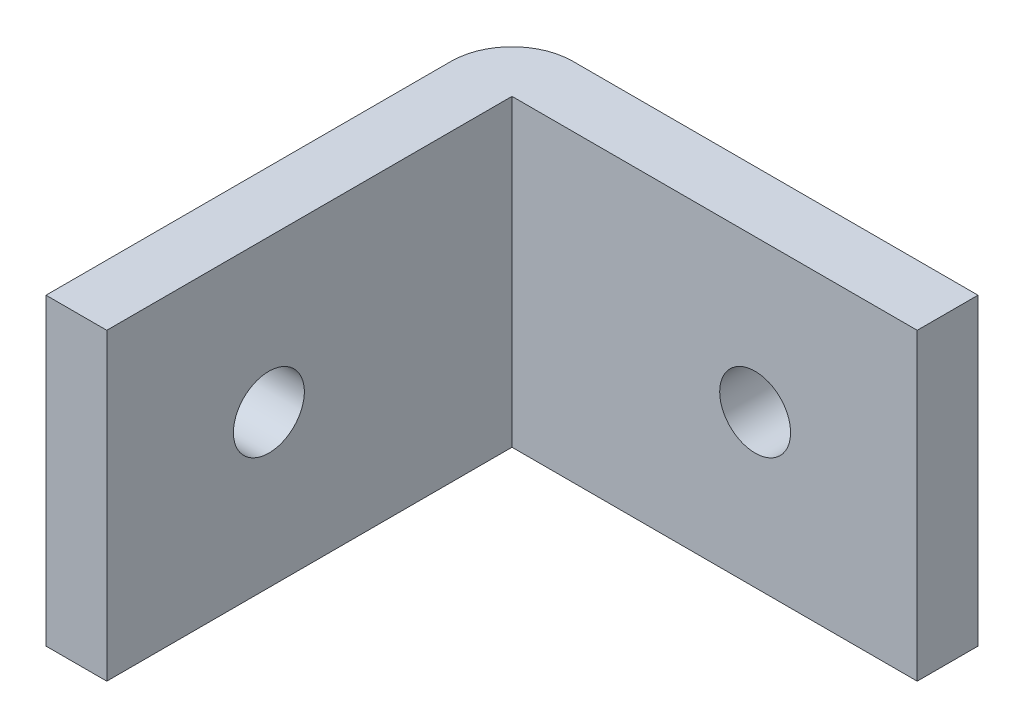
ISO-10303-21;
HEADER;
FILE_DESCRIPTION(('STEP AP214'),'2;1');
FILE_NAME('part.step','',(''),(''),'','','');
FILE_SCHEMA(('AUTOMOTIVE_DESIGN { 1 0 10303 214 1 1 1 1 }'));
ENDSEC;
DATA;
#1=APPLICATION_CONTEXT('core data for automotive mechanical design processes');
#2=APPLICATION_PROTOCOL_DEFINITION('international standard','automotive_design',2000,#1);
#3=PRODUCT_CONTEXT('',#1,'mechanical');
#4=PRODUCT('Part','Part','',(#3));
#5=PRODUCT_RELATED_PRODUCT_CATEGORY('part','',(#4));
#6=PRODUCT_DEFINITION_FORMATION('','',#4);
#7=PRODUCT_DEFINITION_CONTEXT('part definition',#1,'design');
#8=PRODUCT_DEFINITION('design','',#6,#7);
#9=PRODUCT_DEFINITION_SHAPE('','',#8);
#10=(LENGTH_UNIT() NAMED_UNIT(*) SI_UNIT(.MILLI.,.METRE.));
#11=(NAMED_UNIT(*) PLANE_ANGLE_UNIT() SI_UNIT($,.RADIAN.));
#12=(NAMED_UNIT(*) SI_UNIT($,.STERADIAN.) SOLID_ANGLE_UNIT());
#13=UNCERTAINTY_MEASURE_WITH_UNIT(LENGTH_MEASURE(1.E-05),#10,'distance_accuracy_value','');
#14=(GEOMETRIC_REPRESENTATION_CONTEXT(3) GLOBAL_UNCERTAINTY_ASSIGNED_CONTEXT((#13)) GLOBAL_UNIT_ASSIGNED_CONTEXT((#10,
#11,#12)) REPRESENTATION_CONTEXT('',''));
#15=CARTESIAN_POINT('',(0.,0.,0.));
#16=DIRECTION('',(0.,0.,1.));
#17=DIRECTION('',(1.,0.,0.));
#18=AXIS2_PLACEMENT_3D('',#15,#16,#17);
#19=CARTESIAN_POINT('',(0.,0.,3.));
#20=DIRECTION('',(0.,0.,-1.));
#21=DIRECTION('',(-1.,0.,0.));
#22=AXIS2_PLACEMENT_3D('',#19,#20,#21);
#23=PLANE('',#22);
#24=CARTESIAN_POINT('',(3.5,0.,3.));
#25=DIRECTION('',(0.,0.,-1.));
#26=DIRECTION('',(-1.,0.,0.));
#27=AXIS2_PLACEMENT_3D('',#24,#25,#26);
#28=CIRCLE('',#27,1.75);
#29=CARTESIAN_POINT('',(1.75,0.,3.));
#30=VERTEX_POINT('',#29);
#31=EDGE_CURVE('E120',#30,#30,#28,.T.);
#32=ORIENTED_EDGE('',*,*,#31,.T.);
#33=EDGE_LOOP('',(#32));
#34=FACE_BOUND('',#33,.T.);
#35=DIRECTION('',(0.,1.,0.));
#36=VECTOR('',#35,1.);
#37=CARTESIAN_POINT('',(-8.5,7.5,3.));
#38=LINE('',#37,#36);
#39=CARTESIAN_POINT('',(-8.5,-7.5,3.));
#40=VERTEX_POINT('',#39);
#41=CARTESIAN_POINT('',(-8.5,7.5,3.));
#42=VERTEX_POINT('',#41);
#43=EDGE_CURVE('E117',#40,#42,#38,.T.);
#44=ORIENTED_EDGE('',*,*,#43,.F.);
#45=DIRECTION('',(1.,0.,0.));
#46=VECTOR('',#45,1.);
#47=CARTESIAN_POINT('',(-11.5,-7.5,3.));
#48=LINE('',#47,#46);
#49=CARTESIAN_POINT('',(11.5,-7.5,3.));
#50=VERTEX_POINT('',#49);
#51=EDGE_CURVE('E138',#40,#50,#48,.T.);
#52=ORIENTED_EDGE('',*,*,#51,.T.);
#53=DIRECTION('',(0.,1.,0.));
#54=VECTOR('',#53,1.);
#55=CARTESIAN_POINT('',(11.5,-7.5,3.));
#56=LINE('',#55,#54);
#57=CARTESIAN_POINT('',(11.5,7.5,3.));
#58=VERTEX_POINT('',#57);
#59=EDGE_CURVE('E132',#50,#58,#56,.T.);
#60=ORIENTED_EDGE('',*,*,#59,.T.);
#61=DIRECTION('',(-1.,0.,0.));
#62=VECTOR('',#61,1.);
#63=CARTESIAN_POINT('',(-11.5,7.5,3.));
#64=LINE('',#63,#62);
#65=EDGE_CURVE('E135',#58,#42,#64,.T.);
#66=ORIENTED_EDGE('',*,*,#65,.T.);
#67=EDGE_LOOP('',(#44,#52,#60,#66));
#68=FACE_BOUND('',#67,.T.);
#69=ADVANCED_FACE('F35',(#34,#68),#23,.F.);
#70=CARTESIAN_POINT('',(11.5,-7.5,3.));
#71=DIRECTION('',(-1.,0.,0.));
#72=DIRECTION('',(0.,0.,1.));
#73=AXIS2_PLACEMENT_3D('',#70,#71,#72);
#74=PLANE('',#73);
#75=DIRECTION('',(0.,1.,0.));
#76=VECTOR('',#75,1.);
#77=CARTESIAN_POINT('',(11.5,-7.5,0.));
#78=LINE('',#77,#76);
#79=CARTESIAN_POINT('',(11.5,-7.5,0.));
#80=VERTEX_POINT('',#79);
#81=CARTESIAN_POINT('',(11.5,7.5,0.));
#82=VERTEX_POINT('',#81);
#83=EDGE_CURVE('E131',#80,#82,#78,.T.);
#84=ORIENTED_EDGE('',*,*,#83,.T.);
#85=DIRECTION('',(0.,0.,-1.));
#86=VECTOR('',#85,1.);
#87=CARTESIAN_POINT('',(11.5,7.5,3.));
#88=LINE('',#87,#86);
#89=EDGE_CURVE('E148',#58,#82,#88,.T.);
#90=ORIENTED_EDGE('',*,*,#89,.F.);
#91=ORIENTED_EDGE('',*,*,#59,.F.);
#92=DIRECTION('',(0.,0.,-1.));
#93=VECTOR('',#92,1.);
#94=CARTESIAN_POINT('',(11.5,-7.5,3.));
#95=LINE('',#94,#93);
#96=EDGE_CURVE('E101',#50,#80,#95,.T.);
#97=ORIENTED_EDGE('',*,*,#96,.T.);
#98=EDGE_LOOP('',(#84,#90,#91,#97));
#99=FACE_BOUND('',#98,.T.);
#100=ADVANCED_FACE('F176',(#99),#74,.F.);
#101=CARTESIAN_POINT('',(-11.5,7.5,3.));
#102=DIRECTION('',(0.,-1.,0.));
#103=DIRECTION('',(0.,0.,-1.));
#104=AXIS2_PLACEMENT_3D('',#101,#102,#103);
#105=PLANE('',#104);
#106=DIRECTION('',(-1.,0.,0.));
#107=VECTOR('',#106,1.);
#108=CARTESIAN_POINT('',(-11.5,7.5,0.));
#109=LINE('',#108,#107);
#110=CARTESIAN_POINT('',(-8.5,7.5,0.));
#111=VERTEX_POINT('',#110);
#112=EDGE_CURVE('E142',#82,#111,#109,.T.);
#113=ORIENTED_EDGE('',*,*,#112,.T.);
#114=CARTESIAN_POINT('',(-8.5,7.5,3.));
#115=DIRECTION('',(0.,-1.,0.));
#116=DIRECTION('',(0.,0.,-1.));
#117=AXIS2_PLACEMENT_3D('',#114,#115,#116);
#118=CIRCLE('',#117,3.);
#119=CARTESIAN_POINT('',(-11.5,7.5,3.));
#120=VERTEX_POINT('',#119);
#121=EDGE_CURVE('E11',#111,#120,#118,.F.);
#122=ORIENTED_EDGE('',*,*,#121,.T.);
#123=DIRECTION('',(0.,0.,-1.));
#124=VECTOR('',#123,1.);
#125=CARTESIAN_POINT('',(-11.5,7.5,3.));
#126=LINE('',#125,#124);
#127=CARTESIAN_POINT('',(-11.5,7.5,23.));
#128=VERTEX_POINT('',#127);
#129=EDGE_CURVE('E100',#128,#120,#126,.T.);
#130=ORIENTED_EDGE('',*,*,#129,.F.);
#131=DIRECTION('',(-1.,0.,0.));
#132=VECTOR('',#131,1.);
#133=CARTESIAN_POINT('',(-11.5,7.5,23.));
#134=LINE('',#133,#132);
#135=CARTESIAN_POINT('',(-8.5,7.5,23.));
#136=VERTEX_POINT('',#135);
#137=EDGE_CURVE('E116',#136,#128,#134,.T.);
#138=ORIENTED_EDGE('',*,*,#137,.F.);
#139=DIRECTION('',(0.,0.,-1.));
#140=VECTOR('',#139,1.);
#141=CARTESIAN_POINT('',(-8.5,7.5,23.));
#142=LINE('',#141,#140);
#143=EDGE_CURVE('E126',#136,#42,#142,.T.);
#144=ORIENTED_EDGE('',*,*,#143,.T.);
#145=ORIENTED_EDGE('',*,*,#65,.F.);
#146=ORIENTED_EDGE('',*,*,#89,.T.);
#147=EDGE_LOOP('',(#113,#122,#130,#138,#144,#145,#146));
#148=FACE_BOUND('',#147,.T.);
#149=ADVANCED_FACE('F168',(#148),#105,.F.);
#150=CARTESIAN_POINT('',(-11.5,-7.5,3.));
#151=DIRECTION('',(1.,0.,0.));
#152=DIRECTION('',(0.,0.,-1.));
#153=AXIS2_PLACEMENT_3D('',#150,#151,#152);
#154=PLANE('',#153);
#155=CARTESIAN_POINT('',(-11.5,0.,15.));
#156=DIRECTION('',(-1.,0.,0.));
#157=DIRECTION('',(0.,0.,1.));
#158=AXIS2_PLACEMENT_3D('',#155,#156,#157);
#159=CIRCLE('',#158,1.75);
#160=CARTESIAN_POINT('',(-11.5,0.,16.75));
#161=VERTEX_POINT('',#160);
#162=EDGE_CURVE('E155',#161,#161,#159,.T.);
#163=ORIENTED_EDGE('',*,*,#162,.F.);
#164=EDGE_LOOP('',(#163));
#165=FACE_BOUND('',#164,.T.);
#166=ORIENTED_EDGE('',*,*,#129,.T.);
#167=DIRECTION('',(0.,-1.,0.));
#168=VECTOR('',#167,1.);
#169=CARTESIAN_POINT('',(-11.5,-7.5,3.));
#170=LINE('',#169,#168);
#171=CARTESIAN_POINT('',(-11.5,-7.5,3.));
#172=VERTEX_POINT('',#171);
#173=EDGE_CURVE('E99',#120,#172,#170,.T.);
#174=ORIENTED_EDGE('',*,*,#173,.T.);
#175=DIRECTION('',(0.,0.,-1.));
#176=VECTOR('',#175,1.);
#177=CARTESIAN_POINT('',(-11.5,-7.5,3.));
#178=LINE('',#177,#176);
#179=CARTESIAN_POINT('',(-11.5,-7.5,23.));
#180=VERTEX_POINT('',#179);
#181=EDGE_CURVE('E92',#180,#172,#178,.T.);
#182=ORIENTED_EDGE('',*,*,#181,.F.);
#183=DIRECTION('',(0.,-1.,0.));
#184=VECTOR('',#183,1.);
#185=CARTESIAN_POINT('',(-11.5,7.5,23.));
#186=LINE('',#185,#184);
#187=EDGE_CURVE('E97',#128,#180,#186,.T.);
#188=ORIENTED_EDGE('',*,*,#187,.F.);
#189=EDGE_LOOP('',(#166,#174,#182,#188));
#190=FACE_BOUND('',#189,.T.);
#191=ADVANCED_FACE('F95',(#165,#190),#154,.F.);
#192=CARTESIAN_POINT('',(-11.5,-7.5,3.));
#193=DIRECTION('',(0.,1.,0.));
#194=DIRECTION('',(0.,0.,1.));
#195=AXIS2_PLACEMENT_3D('',#192,#193,#194);
#196=PLANE('',#195);
#197=ORIENTED_EDGE('',*,*,#181,.T.);
#198=CARTESIAN_POINT('',(-8.5,-7.5,3.));
#199=DIRECTION('',(0.,1.,0.));
#200=DIRECTION('',(0.,0.,1.));
#201=AXIS2_PLACEMENT_3D('',#198,#199,#200);
#202=CIRCLE('',#201,3.);
#203=CARTESIAN_POINT('',(-8.5,-7.5,0.));
#204=VERTEX_POINT('',#203);
#205=EDGE_CURVE('E57',#172,#204,#202,.F.);
#206=ORIENTED_EDGE('',*,*,#205,.T.);
#207=DIRECTION('',(1.,0.,0.));
#208=VECTOR('',#207,1.);
#209=CARTESIAN_POINT('',(-11.5,-7.5,0.));
#210=LINE('',#209,#208);
#211=EDGE_CURVE('E136',#204,#80,#210,.T.);
#212=ORIENTED_EDGE('',*,*,#211,.T.);
#213=ORIENTED_EDGE('',*,*,#96,.F.);
#214=ORIENTED_EDGE('',*,*,#51,.F.);
#215=DIRECTION('',(0.,0.,-1.));
#216=VECTOR('',#215,1.);
#217=CARTESIAN_POINT('',(-8.5,-7.5,23.));
#218=LINE('',#217,#216);
#219=CARTESIAN_POINT('',(-8.5,-7.5,23.));
#220=VERTEX_POINT('',#219);
#221=EDGE_CURVE('E108',#220,#40,#218,.T.);
#222=ORIENTED_EDGE('',*,*,#221,.F.);
#223=DIRECTION('',(1.,0.,0.));
#224=VECTOR('',#223,1.);
#225=CARTESIAN_POINT('',(-11.5,-7.5,23.));
#226=LINE('',#225,#224);
#227=EDGE_CURVE('E104',#180,#220,#226,.T.);
#228=ORIENTED_EDGE('',*,*,#227,.F.);
#229=EDGE_LOOP('',(#197,#206,#212,#213,#214,#222,#228));
#230=FACE_BOUND('',#229,.T.);
#231=ADVANCED_FACE('F105',(#230),#196,.F.);
#232=CARTESIAN_POINT('',(0.,0.,0.));
#233=DIRECTION('',(0.,0.,-1.));
#234=DIRECTION('',(-1.,0.,0.));
#235=AXIS2_PLACEMENT_3D('',#232,#233,#234);
#236=PLANE('',#235);
#237=CARTESIAN_POINT('',(3.5,0.,0.));
#238=DIRECTION('',(0.,0.,-1.));
#239=DIRECTION('',(-1.,0.,0.));
#240=AXIS2_PLACEMENT_3D('',#237,#238,#239);
#241=CIRCLE('',#240,1.75);
#242=CARTESIAN_POINT('',(1.75,0.,0.));
#243=VERTEX_POINT('',#242);
#244=EDGE_CURVE('E154',#243,#243,#241,.T.);
#245=ORIENTED_EDGE('',*,*,#244,.F.);
#246=EDGE_LOOP('',(#245));
#247=FACE_BOUND('',#246,.T.);
#248=ORIENTED_EDGE('',*,*,#211,.F.);
#249=DIRECTION('',(0.,-1.,0.));
#250=VECTOR('',#249,1.);
#251=CARTESIAN_POINT('',(-8.5,7.5,0.));
#252=LINE('',#251,#250);
#253=EDGE_CURVE('E43',#204,#111,#252,.F.);
#254=ORIENTED_EDGE('',*,*,#253,.T.);
#255=ORIENTED_EDGE('',*,*,#112,.F.);
#256=ORIENTED_EDGE('',*,*,#83,.F.);
#257=EDGE_LOOP('',(#248,#254,#255,#256));
#258=FACE_BOUND('',#257,.T.);
#259=ADVANCED_FACE('F174',(#247,#258),#236,.T.);
#260=CARTESIAN_POINT('',(-8.5,7.5,23.));
#261=DIRECTION('',(-1.,0.,0.));
#262=DIRECTION('',(0.,0.,1.));
#263=AXIS2_PLACEMENT_3D('',#260,#261,#262);
#264=PLANE('',#263);
#265=CARTESIAN_POINT('',(-8.5,0.,15.));
#266=DIRECTION('',(-1.,0.,0.));
#267=DIRECTION('',(0.,0.,1.));
#268=AXIS2_PLACEMENT_3D('',#265,#266,#267);
#269=CIRCLE('',#268,1.75);
#270=CARTESIAN_POINT('',(-8.5,0.,16.75));
#271=VERTEX_POINT('',#270);
#272=EDGE_CURVE('E151',#271,#271,#269,.T.);
#273=ORIENTED_EDGE('',*,*,#272,.T.);
#274=EDGE_LOOP('',(#273));
#275=FACE_BOUND('',#274,.T.);
#276=ORIENTED_EDGE('',*,*,#43,.T.);
#277=ORIENTED_EDGE('',*,*,#143,.F.);
#278=DIRECTION('',(0.,1.,0.));
#279=VECTOR('',#278,1.);
#280=CARTESIAN_POINT('',(-8.5,7.5,23.));
#281=LINE('',#280,#279);
#282=EDGE_CURVE('E111',#220,#136,#281,.T.);
#283=ORIENTED_EDGE('',*,*,#282,.F.);
#284=ORIENTED_EDGE('',*,*,#221,.T.);
#285=EDGE_LOOP('',(#276,#277,#283,#284));
#286=FACE_BOUND('',#285,.T.);
#287=ADVANCED_FACE('F190',(#275,#286),#264,.F.);
#288=CARTESIAN_POINT('',(0.,0.,23.));
#289=DIRECTION('',(0.,0.,1.));
#290=DIRECTION('',(1.,0.,0.));
#291=AXIS2_PLACEMENT_3D('',#288,#289,#290);
#292=PLANE('',#291);
#293=ORIENTED_EDGE('',*,*,#187,.T.);
#294=ORIENTED_EDGE('',*,*,#227,.T.);
#295=ORIENTED_EDGE('',*,*,#282,.T.);
#296=ORIENTED_EDGE('',*,*,#137,.T.);
#297=EDGE_LOOP('',(#293,#294,#295,#296));
#298=FACE_BOUND('',#297,.T.);
#299=ADVANCED_FACE('F114',(#298),#292,.T.);
#300=CARTESIAN_POINT('',(3.5,0.,23.));
#301=DIRECTION('',(0.,0.,-1.));
#302=DIRECTION('',(-1.,0.,0.));
#303=AXIS2_PLACEMENT_3D('',#300,#301,#302);
#304=CYLINDRICAL_SURFACE('',#303,1.75);
#305=ORIENTED_EDGE('',*,*,#244,.T.);
#306=EDGE_LOOP('',(#305));
#307=FACE_BOUND('',#306,.T.);
#308=ORIENTED_EDGE('',*,*,#31,.F.);
#309=EDGE_LOOP('',(#308));
#310=FACE_BOUND('',#309,.T.);
#311=ADVANCED_FACE('F210',(#307,#310),#304,.F.);
#312=CARTESIAN_POINT('',(11.5,0.,15.));
#313=DIRECTION('',(-1.,0.,0.));
#314=DIRECTION('',(0.,0.,1.));
#315=AXIS2_PLACEMENT_3D('',#312,#313,#314);
#316=CYLINDRICAL_SURFACE('',#315,1.75);
#317=ORIENTED_EDGE('',*,*,#162,.T.);
#318=EDGE_LOOP('',(#317));
#319=FACE_BOUND('',#318,.T.);
#320=ORIENTED_EDGE('',*,*,#272,.F.);
#321=EDGE_LOOP('',(#320));
#322=FACE_BOUND('',#321,.T.);
#323=ADVANCED_FACE('F164',(#319,#322),#316,.F.);
#324=CARTESIAN_POINT('',(-8.5,-7.5,3.));
#325=DIRECTION('',(0.,1.,0.));
#326=DIRECTION('',(0.,0.,1.));
#327=AXIS2_PLACEMENT_3D('',#324,#325,#326);
#328=CYLINDRICAL_SURFACE('',#327,3.);
#329=ORIENTED_EDGE('',*,*,#121,.F.);
#330=ORIENTED_EDGE('',*,*,#253,.F.);
#331=ORIENTED_EDGE('',*,*,#205,.F.);
#332=ORIENTED_EDGE('',*,*,#173,.F.);
#333=EDGE_LOOP('',(#329,#330,#331,#332));
#334=FACE_BOUND('',#333,.T.);
#335=ADVANCED_FACE('F37',(#334),#328,.T.);
#336=CLOSED_SHELL('',(#69,#100,#149,#191,#231,#259,#287,#299,#311,#323,#335));
#337=MANIFOLD_SOLID_BREP('B2',#336);
#338=ADVANCED_BREP_SHAPE_REPRESENTATION('',(#18,#337),#14);
#339=SHAPE_DEFINITION_REPRESENTATION(#9,#338);
ENDSEC;
END-ISO-10303-21;
